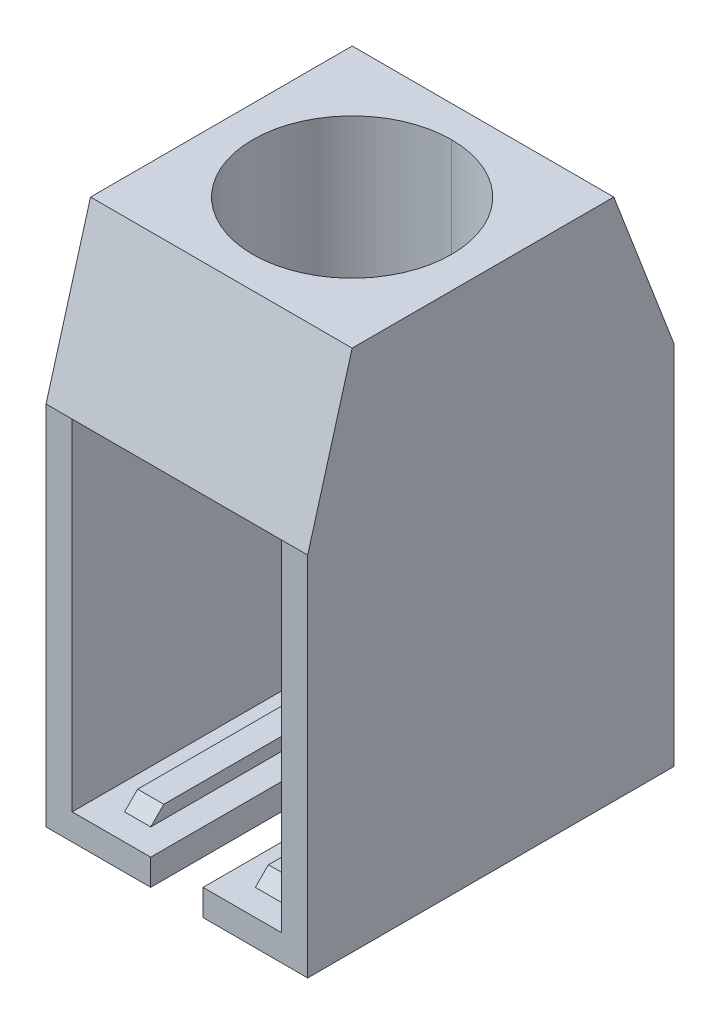
ISO-10303-21;
HEADER;
FILE_DESCRIPTION(('STEP AP214'),'2;1');
FILE_NAME('part.step','',(''),(''),'','','');
FILE_SCHEMA(('AUTOMOTIVE_DESIGN { 1 0 10303 214 1 1 1 1 }'));
ENDSEC;
DATA;
#1=APPLICATION_CONTEXT('core data for automotive mechanical design processes');
#2=APPLICATION_PROTOCOL_DEFINITION('international standard','automotive_design',2000,#1);
#3=PRODUCT_CONTEXT('',#1,'mechanical');
#4=PRODUCT('Part','Part','',(#3));
#5=PRODUCT_RELATED_PRODUCT_CATEGORY('part','',(#4));
#6=PRODUCT_DEFINITION_FORMATION('','',#4);
#7=PRODUCT_DEFINITION_CONTEXT('part definition',#1,'design');
#8=PRODUCT_DEFINITION('design','',#6,#7);
#9=PRODUCT_DEFINITION_SHAPE('','',#8);
#10=(LENGTH_UNIT() NAMED_UNIT(*) SI_UNIT(.MILLI.,.METRE.));
#11=(NAMED_UNIT(*) PLANE_ANGLE_UNIT() SI_UNIT($,.RADIAN.));
#12=(NAMED_UNIT(*) SI_UNIT($,.STERADIAN.) SOLID_ANGLE_UNIT());
#13=UNCERTAINTY_MEASURE_WITH_UNIT(LENGTH_MEASURE(1.E-05),#10,'distance_accuracy_value','');
#14=(GEOMETRIC_REPRESENTATION_CONTEXT(3) GLOBAL_UNCERTAINTY_ASSIGNED_CONTEXT((#13)) GLOBAL_UNIT_ASSIGNED_CONTEXT((#10,
#11,#12)) REPRESENTATION_CONTEXT('',''));
#15=CARTESIAN_POINT('',(0.,0.,0.));
#16=DIRECTION('',(0.,0.,1.));
#17=DIRECTION('',(1.,0.,0.));
#18=AXIS2_PLACEMENT_3D('',#15,#16,#17);
#19=CARTESIAN_POINT('',(-2.,6.5,3.));
#20=DIRECTION('',(0.,0.707106781186548,-0.707106781186547));
#21=DIRECTION('',(-1.,0.,0.));
#22=AXIS2_PLACEMENT_3D('',#19,#20,#21);
#23=PLANE('',#22);
#24=DIRECTION('',(0.,-0.707106781186547,-0.707106781186548));
#25=VECTOR('',#24,1.);
#26=CARTESIAN_POINT('',(2.,-0.355551275463989,-3.85555127546401));
#27=LINE('',#26,#25);
#28=CARTESIAN_POINT('',(2.,7.,3.5));
#29=VERTEX_POINT('',#28);
#30=CARTESIAN_POINT('',(2.,6.5,3.));
#31=VERTEX_POINT('',#30);
#32=EDGE_CURVE('E277',#29,#31,#27,.T.);
#33=ORIENTED_EDGE('',*,*,#32,.F.);
#34=DIRECTION('',(1.,0.,0.));
#35=VECTOR('',#34,1.);
#36=CARTESIAN_POINT('',(-2.5,7.,3.5));
#37=LINE('',#36,#35);
#38=CARTESIAN_POINT('',(-2.,7.,3.5));
#39=VERTEX_POINT('',#38);
#40=EDGE_CURVE('E261',#39,#29,#37,.T.);
#41=ORIENTED_EDGE('',*,*,#40,.F.);
#42=DIRECTION('',(0.,0.707106781186547,0.707106781186548));
#43=VECTOR('',#42,1.);
#44=CARTESIAN_POINT('',(-2.,-0.355551275463989,-3.85555127546401));
#45=LINE('',#44,#43);
#46=CARTESIAN_POINT('',(-2.,6.5,3.));
#47=VERTEX_POINT('',#46);
#48=EDGE_CURVE('E257',#47,#39,#45,.T.);
#49=ORIENTED_EDGE('',*,*,#48,.F.);
#50=DIRECTION('',(-1.,0.,0.));
#51=VECTOR('',#50,1.);
#52=CARTESIAN_POINT('',(-2.,6.5,3.));
#53=LINE('',#52,#51);
#54=EDGE_CURVE('E242',#31,#47,#53,.T.);
#55=ORIENTED_EDGE('',*,*,#54,.F.);
#56=EDGE_LOOP('',(#33,#41,#49,#55));
#57=FACE_BOUND('',#56,.T.);
#58=ADVANCED_FACE('F17',(#57),#23,.F.);
#59=CARTESIAN_POINT('',(0.,0.75,2.75));
#60=DIRECTION('',(0.,0.707106781186545,0.70710678118655));
#61=DIRECTION('',(1.,0.,0.));
#62=AXIS2_PLACEMENT_3D('',#59,#60,#61);
#63=PLANE('',#62);
#64=DIRECTION('',(0.,0.70710678118655,-0.707106781186545));
#65=VECTOR('',#64,1.);
#66=CARTESIAN_POINT('',(-1.5,0.749999999999976,2.75));
#67=LINE('',#66,#65);
#68=CARTESIAN_POINT('',(-1.5,0.5,3.));
#69=VERTEX_POINT('',#68);
#70=CARTESIAN_POINT('',(-1.5,0.75,2.75));
#71=VERTEX_POINT('',#70);
#72=EDGE_CURVE('E291',#69,#71,#67,.T.);
#73=ORIENTED_EDGE('',*,*,#72,.F.);
#74=DIRECTION('',(1.,0.,0.));
#75=VECTOR('',#74,1.);
#76=CARTESIAN_POINT('',(0.,0.5,3.));
#77=LINE('',#76,#75);
#78=CARTESIAN_POINT('',(-1.,0.5,3.));
#79=VERTEX_POINT('',#78);
#80=EDGE_CURVE('E377',#69,#79,#77,.T.);
#81=ORIENTED_EDGE('',*,*,#80,.T.);
#82=DIRECTION('',(0.,-0.70710678118655,0.707106781186545));
#83=VECTOR('',#82,1.);
#84=CARTESIAN_POINT('',(-1.,2.125,1.375));
#85=LINE('',#84,#83);
#86=CARTESIAN_POINT('',(-1.,0.75,2.75));
#87=VERTEX_POINT('',#86);
#88=EDGE_CURVE('E285',#87,#79,#85,.T.);
#89=ORIENTED_EDGE('',*,*,#88,.F.);
#90=DIRECTION('',(1.,0.,0.));
#91=VECTOR('',#90,1.);
#92=CARTESIAN_POINT('',(-1.,0.75,2.75));
#93=LINE('',#92,#91);
#94=EDGE_CURVE('E288',#71,#87,#93,.T.);
#95=ORIENTED_EDGE('',*,*,#94,.F.);
#96=EDGE_LOOP('',(#73,#81,#89,#95));
#97=FACE_BOUND('',#96,.T.);
#98=ADVANCED_FACE('F630',(#97),#63,.T.);
#99=CARTESIAN_POINT('',(0.,0.75,2.75));
#100=DIRECTION('',(0.,0.707106781186545,0.70710678118655));
#101=DIRECTION('',(1.,0.,0.));
#102=AXIS2_PLACEMENT_3D('',#99,#100,#101);
#103=PLANE('',#102);
#104=DIRECTION('',(0.,0.70710678118655,-0.707106781186545));
#105=VECTOR('',#104,1.);
#106=CARTESIAN_POINT('',(1.,0.75,2.75));
#107=LINE('',#106,#105);
#108=CARTESIAN_POINT('',(1.,0.5,3.));
#109=VERTEX_POINT('',#108);
#110=CARTESIAN_POINT('',(1.,0.75,2.75));
#111=VERTEX_POINT('',#110);
#112=EDGE_CURVE('E308',#109,#111,#107,.T.);
#113=ORIENTED_EDGE('',*,*,#112,.F.);
#114=DIRECTION('',(1.,0.,0.));
#115=VECTOR('',#114,1.);
#116=CARTESIAN_POINT('',(0.,0.5,3.));
#117=LINE('',#116,#115);
#118=CARTESIAN_POINT('',(1.5,0.5,3.));
#119=VERTEX_POINT('',#118);
#120=EDGE_CURVE('E352',#109,#119,#117,.T.);
#121=ORIENTED_EDGE('',*,*,#120,.T.);
#122=DIRECTION('',(0.,-0.70710678118655,0.707106781186545));
#123=VECTOR('',#122,1.);
#124=CARTESIAN_POINT('',(1.5,2.125,1.375));
#125=LINE('',#124,#123);
#126=CARTESIAN_POINT('',(1.5,0.75,2.75));
#127=VERTEX_POINT('',#126);
#128=EDGE_CURVE('E304',#127,#119,#125,.T.);
#129=ORIENTED_EDGE('',*,*,#128,.F.);
#130=DIRECTION('',(1.,0.,0.));
#131=VECTOR('',#130,1.);
#132=CARTESIAN_POINT('',(1.5,0.75,2.75));
#133=LINE('',#132,#131);
#134=EDGE_CURVE('E11',#111,#127,#133,.T.);
#135=ORIENTED_EDGE('',*,*,#134,.F.);
#136=EDGE_LOOP('',(#113,#121,#129,#135));
#137=FACE_BOUND('',#136,.T.);
#138=ADVANCED_FACE('F634',(#137),#103,.T.);
#139=CARTESIAN_POINT('',(0.,0.75,0.));
#140=DIRECTION('',(0.,1.,0.));
#141=DIRECTION('',(1.,0.,0.));
#142=AXIS2_PLACEMENT_3D('',#139,#140,#141);
#143=PLANE('',#142);
#144=DIRECTION('',(0.,0.,1.));
#145=VECTOR('',#144,1.);
#146=CARTESIAN_POINT('',(1.,0.75,0.));
#147=LINE('',#146,#145);
#148=CARTESIAN_POINT('',(1.,0.75,-3.));
#149=VERTEX_POINT('',#148);
#150=EDGE_CURVE('E20',#149,#111,#147,.T.);
#151=ORIENTED_EDGE('',*,*,#150,.T.);
#152=ORIENTED_EDGE('',*,*,#134,.T.);
#153=DIRECTION('',(0.,0.,1.));
#154=VECTOR('',#153,1.);
#155=CARTESIAN_POINT('',(1.5,0.75,0.));
#156=LINE('',#155,#154);
#157=CARTESIAN_POINT('',(1.5,0.75,-3.));
#158=VERTEX_POINT('',#157);
#159=EDGE_CURVE('E300',#158,#127,#156,.T.);
#160=ORIENTED_EDGE('',*,*,#159,.F.);
#161=DIRECTION('',(-1.,0.,0.));
#162=VECTOR('',#161,1.);
#163=CARTESIAN_POINT('',(0.,0.75,-3.));
#164=LINE('',#163,#162);
#165=EDGE_CURVE('E359',#158,#149,#164,.T.);
#166=ORIENTED_EDGE('',*,*,#165,.T.);
#167=EDGE_LOOP('',(#151,#152,#160,#166));
#168=FACE_BOUND('',#167,.T.);
#169=ADVANCED_FACE('F639',(#168),#143,.T.);
#170=CARTESIAN_POINT('',(1.,0.75,0.));
#171=DIRECTION('',(1.,0.,0.));
#172=DIRECTION('',(0.,0.,-1.));
#173=AXIS2_PLACEMENT_3D('',#170,#171,#172);
#174=PLANE('',#173);
#175=DIRECTION('',(0.,0.,1.));
#176=VECTOR('',#175,1.);
#177=CARTESIAN_POINT('',(1.,0.5,0.));
#178=LINE('',#177,#176);
#179=CARTESIAN_POINT('',(1.,0.5,-3.));
#180=VERTEX_POINT('',#179);
#181=EDGE_CURVE('E355',#180,#109,#178,.T.);
#182=ORIENTED_EDGE('',*,*,#181,.T.);
#183=ORIENTED_EDGE('',*,*,#112,.T.);
#184=ORIENTED_EDGE('',*,*,#150,.F.);
#185=DIRECTION('',(0.,-1.,0.));
#186=VECTOR('',#185,1.);
#187=CARTESIAN_POINT('',(1.,0.75,-3.));
#188=LINE('',#187,#186);
#189=EDGE_CURVE('E364',#149,#180,#188,.T.);
#190=ORIENTED_EDGE('',*,*,#189,.T.);
#191=EDGE_LOOP('',(#182,#183,#184,#190));
#192=FACE_BOUND('',#191,.T.);
#193=ADVANCED_FACE('F644',(#192),#174,.F.);
#194=CARTESIAN_POINT('',(1.5,0.75,0.));
#195=DIRECTION('',(1.,0.,0.));
#196=DIRECTION('',(0.,0.,-1.));
#197=AXIS2_PLACEMENT_3D('',#194,#195,#196);
#198=PLANE('',#197);
#199=ORIENTED_EDGE('',*,*,#159,.T.);
#200=ORIENTED_EDGE('',*,*,#128,.T.);
#201=DIRECTION('',(0.,0.,1.));
#202=VECTOR('',#201,1.);
#203=CARTESIAN_POINT('',(1.5,0.5,0.));
#204=LINE('',#203,#202);
#205=CARTESIAN_POINT('',(1.5,0.5,-3.));
#206=VERTEX_POINT('',#205);
#207=EDGE_CURVE('E336',#206,#119,#204,.T.);
#208=ORIENTED_EDGE('',*,*,#207,.F.);
#209=DIRECTION('',(0.,-1.,0.));
#210=VECTOR('',#209,1.);
#211=CARTESIAN_POINT('',(1.5,0.75,-3.));
#212=LINE('',#211,#210);
#213=EDGE_CURVE('E330',#158,#206,#212,.T.);
#214=ORIENTED_EDGE('',*,*,#213,.F.);
#215=EDGE_LOOP('',(#199,#200,#208,#214));
#216=FACE_BOUND('',#215,.T.);
#217=ADVANCED_FACE('F648',(#216),#198,.T.);
#218=CARTESIAN_POINT('',(0.,0.75,0.));
#219=DIRECTION('',(0.,1.,0.));
#220=DIRECTION('',(1.,0.,0.));
#221=AXIS2_PLACEMENT_3D('',#218,#219,#220);
#222=PLANE('',#221);
#223=DIRECTION('',(0.,0.,1.));
#224=VECTOR('',#223,1.);
#225=CARTESIAN_POINT('',(-1.5,0.75,0.));
#226=LINE('',#225,#224);
#227=CARTESIAN_POINT('',(-1.5,0.75,-3.));
#228=VERTEX_POINT('',#227);
#229=EDGE_CURVE('E296',#228,#71,#226,.T.);
#230=ORIENTED_EDGE('',*,*,#229,.T.);
#231=ORIENTED_EDGE('',*,*,#94,.T.);
#232=DIRECTION('',(0.,0.,1.));
#233=VECTOR('',#232,1.);
#234=CARTESIAN_POINT('',(-1.,0.75,0.));
#235=LINE('',#234,#233);
#236=CARTESIAN_POINT('',(-1.,0.75,-3.));
#237=VERTEX_POINT('',#236);
#238=EDGE_CURVE('E289',#237,#87,#235,.T.);
#239=ORIENTED_EDGE('',*,*,#238,.F.);
#240=DIRECTION('',(-1.,0.,0.));
#241=VECTOR('',#240,1.);
#242=CARTESIAN_POINT('',(0.,0.75,-3.));
#243=LINE('',#242,#241);
#244=EDGE_CURVE('E346',#237,#228,#243,.T.);
#245=ORIENTED_EDGE('',*,*,#244,.T.);
#246=EDGE_LOOP('',(#230,#231,#239,#245));
#247=FACE_BOUND('',#246,.T.);
#248=ADVANCED_FACE('F651',(#247),#222,.T.);
#249=CARTESIAN_POINT('',(-1.,0.75,0.));
#250=DIRECTION('',(1.,0.,0.));
#251=DIRECTION('',(0.,0.,1.));
#252=AXIS2_PLACEMENT_3D('',#249,#250,#251);
#253=PLANE('',#252);
#254=ORIENTED_EDGE('',*,*,#238,.T.);
#255=ORIENTED_EDGE('',*,*,#88,.T.);
#256=DIRECTION('',(0.,0.,1.));
#257=VECTOR('',#256,1.);
#258=CARTESIAN_POINT('',(-1.,0.5,0.));
#259=LINE('',#258,#257);
#260=CARTESIAN_POINT('',(-1.,0.5,-3.));
#261=VERTEX_POINT('',#260);
#262=EDGE_CURVE('E368',#261,#79,#259,.T.);
#263=ORIENTED_EDGE('',*,*,#262,.F.);
#264=DIRECTION('',(0.,-1.,0.));
#265=VECTOR('',#264,1.);
#266=CARTESIAN_POINT('',(-1.,0.75,-3.));
#267=LINE('',#266,#265);
#268=EDGE_CURVE('E350',#237,#261,#267,.T.);
#269=ORIENTED_EDGE('',*,*,#268,.F.);
#270=EDGE_LOOP('',(#254,#255,#263,#269));
#271=FACE_BOUND('',#270,.T.);
#272=ADVANCED_FACE('F654',(#271),#253,.T.);
#273=CARTESIAN_POINT('',(-1.5,0.75,0.));
#274=DIRECTION('',(1.,0.,0.));
#275=DIRECTION('',(0.,0.,-1.));
#276=AXIS2_PLACEMENT_3D('',#273,#274,#275);
#277=PLANE('',#276);
#278=DIRECTION('',(0.,0.,1.));
#279=VECTOR('',#278,1.);
#280=CARTESIAN_POINT('',(-1.5,0.5,0.));
#281=LINE('',#280,#279);
#282=CARTESIAN_POINT('',(-1.5,0.5,-3.));
#283=VERTEX_POINT('',#282);
#284=EDGE_CURVE('E381',#283,#69,#281,.T.);
#285=ORIENTED_EDGE('',*,*,#284,.T.);
#286=ORIENTED_EDGE('',*,*,#72,.T.);
#287=ORIENTED_EDGE('',*,*,#229,.F.);
#288=DIRECTION('',(0.,-1.,0.));
#289=VECTOR('',#288,1.);
#290=CARTESIAN_POINT('',(-1.5,0.75,-3.));
#291=LINE('',#290,#289);
#292=EDGE_CURVE('E351',#228,#283,#291,.T.);
#293=ORIENTED_EDGE('',*,*,#292,.T.);
#294=EDGE_LOOP('',(#285,#286,#287,#293));
#295=FACE_BOUND('',#294,.T.);
#296=ADVANCED_FACE('F658',(#295),#277,.F.);
#297=CARTESIAN_POINT('',(-0.5,10.001,3.5));
#298=DIRECTION('',(-1.,0.,0.));
#299=DIRECTION('',(0.,0.,1.));
#300=AXIS2_PLACEMENT_3D('',#297,#298,#299);
#301=PLANE('',#300);
#302=DIRECTION('',(0.,0.,1.));
#303=VECTOR('',#302,1.);
#304=CARTESIAN_POINT('',(-0.5,0.5,3.5));
#305=LINE('',#304,#303);
#306=CARTESIAN_POINT('',(-0.5,0.5,0.15));
#307=VERTEX_POINT('',#306);
#308=CARTESIAN_POINT('',(-0.5,0.5,3.5));
#309=VERTEX_POINT('',#308);
#310=EDGE_CURVE('E387',#307,#309,#305,.T.);
#311=ORIENTED_EDGE('',*,*,#310,.T.);
#312=DIRECTION('',(0.,-1.,0.));
#313=VECTOR('',#312,1.);
#314=CARTESIAN_POINT('',(-0.5,10.001,3.5));
#315=LINE('',#314,#313);
#316=CARTESIAN_POINT('',(-0.5,0.,3.5));
#317=VERTEX_POINT('',#316);
#318=EDGE_CURVE('E345',#309,#317,#315,.T.);
#319=ORIENTED_EDGE('',*,*,#318,.T.);
#320=DIRECTION('',(0.,0.,-1.));
#321=VECTOR('',#320,1.);
#322=CARTESIAN_POINT('',(-0.5,0.,3.5));
#323=LINE('',#322,#321);
#324=CARTESIAN_POINT('',(-0.5,0.,0.15));
#325=VERTEX_POINT('',#324);
#326=EDGE_CURVE('E372',#317,#325,#323,.T.);
#327=ORIENTED_EDGE('',*,*,#326,.T.);
#328=DIRECTION('',(0.,-1.,0.));
#329=VECTOR('',#328,1.);
#330=CARTESIAN_POINT('',(-0.5,10.001,0.15));
#331=LINE('',#330,#329);
#332=EDGE_CURVE('E284',#307,#325,#331,.T.);
#333=ORIENTED_EDGE('',*,*,#332,.F.);
#334=EDGE_LOOP('',(#311,#319,#327,#333));
#335=FACE_BOUND('',#334,.T.);
#336=ADVANCED_FACE('F594',(#335),#301,.F.);
#337=CARTESIAN_POINT('',(0.,10.001,0.15));
#338=DIRECTION('',(0.,-1.,0.));
#339=DIRECTION('',(0.,0.,-1.));
#340=AXIS2_PLACEMENT_3D('',#337,#338,#339);
#341=CYLINDRICAL_SURFACE('',#340,0.5);
#342=DIRECTION('',(0.,-1.,0.));
#343=VECTOR('',#342,1.);
#344=CARTESIAN_POINT('',(0.,10.001,-0.35));
#345=LINE('',#344,#343);
#346=CARTESIAN_POINT('',(0.,0.5,-0.35));
#347=VERTEX_POINT('',#346);
#348=CARTESIAN_POINT('',(0.,0.,-0.35));
#349=VERTEX_POINT('',#348);
#350=EDGE_CURVE('E569',#347,#349,#345,.T.);
#351=ORIENTED_EDGE('',*,*,#350,.F.);
#352=CARTESIAN_POINT('',(0.,0.5,0.15));
#353=DIRECTION('',(0.,1.,0.));
#354=DIRECTION('',(0.,0.,-1.));
#355=AXIS2_PLACEMENT_3D('',#352,#353,#354);
#356=CIRCLE('',#355,0.5);
#357=EDGE_CURVE('E382',#347,#307,#356,.T.);
#358=ORIENTED_EDGE('',*,*,#357,.T.);
#359=ORIENTED_EDGE('',*,*,#332,.T.);
#360=CARTESIAN_POINT('',(0.,0.,0.15));
#361=DIRECTION('',(0.,-1.,0.));
#362=DIRECTION('',(0.,0.,-1.));
#363=AXIS2_PLACEMENT_3D('',#360,#361,#362);
#364=CIRCLE('',#363,0.5);
#365=EDGE_CURVE('E369',#325,#349,#364,.T.);
#366=ORIENTED_EDGE('',*,*,#365,.T.);
#367=EDGE_LOOP('',(#351,#358,#359,#366));
#368=FACE_BOUND('',#367,.T.);
#369=ADVANCED_FACE('F663',(#368),#341,.F.);
#370=CARTESIAN_POINT('',(0.5,10.001,0.15));
#371=DIRECTION('',(1.,0.,0.));
#372=DIRECTION('',(0.,0.,1.));
#373=AXIS2_PLACEMENT_3D('',#370,#371,#372);
#374=PLANE('',#373);
#375=DIRECTION('',(0.,0.,-1.));
#376=VECTOR('',#375,1.);
#377=CARTESIAN_POINT('',(0.5,0.5,0.15));
#378=LINE('',#377,#376);
#379=CARTESIAN_POINT('',(0.5,0.5,3.5));
#380=VERTEX_POINT('',#379);
#381=CARTESIAN_POINT('',(0.5,0.5,0.15));
#382=VERTEX_POINT('',#381);
#383=EDGE_CURVE('E386',#380,#382,#378,.T.);
#384=ORIENTED_EDGE('',*,*,#383,.T.);
#385=DIRECTION('',(0.,-1.,0.));
#386=VECTOR('',#385,1.);
#387=CARTESIAN_POINT('',(0.5,10.001,0.15));
#388=LINE('',#387,#386);
#389=CARTESIAN_POINT('',(0.5,0.,0.15));
#390=VERTEX_POINT('',#389);
#391=EDGE_CURVE('E559',#382,#390,#388,.T.);
#392=ORIENTED_EDGE('',*,*,#391,.T.);
#393=DIRECTION('',(0.,0.,1.));
#394=VECTOR('',#393,1.);
#395=CARTESIAN_POINT('',(0.5,0.,0.15));
#396=LINE('',#395,#394);
#397=CARTESIAN_POINT('',(0.5,0.,3.5));
#398=VERTEX_POINT('',#397);
#399=EDGE_CURVE('E373',#390,#398,#396,.T.);
#400=ORIENTED_EDGE('',*,*,#399,.T.);
#401=DIRECTION('',(0.,-1.,0.));
#402=VECTOR('',#401,1.);
#403=CARTESIAN_POINT('',(0.5,10.001,3.5));
#404=LINE('',#403,#402);
#405=EDGE_CURVE('E446',#380,#398,#404,.T.);
#406=ORIENTED_EDGE('',*,*,#405,.F.);
#407=EDGE_LOOP('',(#384,#392,#400,#406));
#408=FACE_BOUND('',#407,.T.);
#409=ADVANCED_FACE('F611',(#408),#374,.F.);
#410=CARTESIAN_POINT('',(0.,-0.000999999999999265,0.15));
#411=DIRECTION('',(0.,1.,0.));
#412=DIRECTION('',(0.,0.,1.));
#413=AXIS2_PLACEMENT_3D('',#410,#411,#412);
#414=CYLINDRICAL_SURFACE('',#413,1.9);
#415=DIRECTION('',(0.,1.,0.));
#416=VECTOR('',#415,1.);
#417=CARTESIAN_POINT('',(0.,-0.000999999999999265,-1.75));
#418=LINE('',#417,#416);
#419=CARTESIAN_POINT('',(0.,6.5,-1.75));
#420=VERTEX_POINT('',#419);
#421=CARTESIAN_POINT('',(0.,10.,-1.75));
#422=VERTEX_POINT('',#421);
#423=EDGE_CURVE('E544',#420,#422,#418,.T.);
#424=ORIENTED_EDGE('',*,*,#423,.F.);
#425=CARTESIAN_POINT('',(0.,6.5,0.15));
#426=DIRECTION('',(0.,-1.,0.));
#427=DIRECTION('',(0.,0.,1.));
#428=AXIS2_PLACEMENT_3D('',#425,#426,#427);
#429=CIRCLE('',#428,1.9);
#430=CARTESIAN_POINT('',(0.,6.5,2.05));
#431=VERTEX_POINT('',#430);
#432=EDGE_CURVE('E256',#420,#431,#429,.T.);
#433=ORIENTED_EDGE('',*,*,#432,.T.);
#434=DIRECTION('',(0.,1.,0.));
#435=VECTOR('',#434,1.);
#436=CARTESIAN_POINT('',(0.,-0.000999999999999265,2.05));
#437=LINE('',#436,#435);
#438=CARTESIAN_POINT('',(0.,10.,2.05));
#439=VERTEX_POINT('',#438);
#440=EDGE_CURVE('E532',#431,#439,#437,.T.);
#441=ORIENTED_EDGE('',*,*,#440,.T.);
#442=CARTESIAN_POINT('',(0.,10.,0.15));
#443=DIRECTION('',(0.,1.,0.));
#444=DIRECTION('',(0.,0.,1.));
#445=AXIS2_PLACEMENT_3D('',#442,#443,#444);
#446=CIRCLE('',#445,1.9);
#447=EDGE_CURVE('E490',#439,#422,#446,.T.);
#448=ORIENTED_EDGE('',*,*,#447,.T.);
#449=EDGE_LOOP('',(#424,#433,#441,#448));
#450=FACE_BOUND('',#449,.T.);
#451=ADVANCED_FACE('F669',(#450),#414,.F.);
#452=CARTESIAN_POINT('',(-2.,6.5,-10.711102550928));
#453=DIRECTION('',(0.,1.,0.));
#454=DIRECTION('',(1.,0.,0.));
#455=AXIS2_PLACEMENT_3D('',#452,#453,#454);
#456=PLANE('',#455);
#457=CARTESIAN_POINT('',(0.,6.5,0.15));
#458=DIRECTION('',(0.,-1.,0.));
#459=DIRECTION('',(0.,0.,1.));
#460=AXIS2_PLACEMENT_3D('',#457,#458,#459);
#461=CIRCLE('',#460,1.9);
#462=EDGE_CURVE('E553',#431,#420,#461,.T.);
#463=ORIENTED_EDGE('',*,*,#462,.F.);
#464=ORIENTED_EDGE('',*,*,#432,.F.);
#465=EDGE_LOOP('',(#463,#464));
#466=FACE_BOUND('',#465,.T.);
#467=DIRECTION('',(0.,0.,1.));
#468=VECTOR('',#467,1.);
#469=CARTESIAN_POINT('',(2.,6.5,-10.711102550928));
#470=LINE('',#469,#468);
#471=CARTESIAN_POINT('',(2.,6.5,-3.));
#472=VERTEX_POINT('',#471);
#473=EDGE_CURVE('E253',#472,#31,#470,.T.);
#474=ORIENTED_EDGE('',*,*,#473,.T.);
#475=ORIENTED_EDGE('',*,*,#54,.T.);
#476=DIRECTION('',(0.,0.,1.));
#477=VECTOR('',#476,1.);
#478=CARTESIAN_POINT('',(-2.,6.5,-10.711102550928));
#479=LINE('',#478,#477);
#480=CARTESIAN_POINT('',(-2.,6.5,-3.));
#481=VERTEX_POINT('',#480);
#482=EDGE_CURVE('E251',#481,#47,#479,.T.);
#483=ORIENTED_EDGE('',*,*,#482,.F.);
#484=DIRECTION('',(1.,0.,0.));
#485=VECTOR('',#484,1.);
#486=CARTESIAN_POINT('',(-2.,6.5,-3.));
#487=LINE('',#486,#485);
#488=EDGE_CURVE('E415',#481,#472,#487,.T.);
#489=ORIENTED_EDGE('',*,*,#488,.T.);
#490=EDGE_LOOP('',(#474,#475,#483,#489));
#491=FACE_BOUND('',#490,.T.);
#492=ADVANCED_FACE('F248',(#466,#491),#456,.F.);
#493=CARTESIAN_POINT('',(-2.,6.5,-10.711102550928));
#494=DIRECTION('',(-1.,0.,0.));
#495=DIRECTION('',(0.,0.,1.));
#496=AXIS2_PLACEMENT_3D('',#493,#494,#495);
#497=PLANE('',#496);
#498=DIRECTION('',(0.,1.,0.));
#499=VECTOR('',#498,1.);
#500=CARTESIAN_POINT('',(-2.,6.5,-3.));
#501=LINE('',#500,#499);
#502=CARTESIAN_POINT('',(-2.,0.5,-3.));
#503=VERTEX_POINT('',#502);
#504=EDGE_CURVE('E269',#503,#481,#501,.T.);
#505=ORIENTED_EDGE('',*,*,#504,.T.);
#506=ORIENTED_EDGE('',*,*,#482,.T.);
#507=ORIENTED_EDGE('',*,*,#48,.T.);
#508=DIRECTION('',(0.,-1.,0.));
#509=VECTOR('',#508,1.);
#510=CARTESIAN_POINT('',(-2.,6.5,3.5));
#511=LINE('',#510,#509);
#512=CARTESIAN_POINT('',(-2.,0.5,3.5));
#513=VERTEX_POINT('',#512);
#514=EDGE_CURVE('E324',#39,#513,#511,.T.);
#515=ORIENTED_EDGE('',*,*,#514,.T.);
#516=DIRECTION('',(0.,0.,1.));
#517=VECTOR('',#516,1.);
#518=CARTESIAN_POINT('',(-2.,0.5,-10.711102550928));
#519=LINE('',#518,#517);
#520=EDGE_CURVE('E401',#503,#513,#519,.T.);
#521=ORIENTED_EDGE('',*,*,#520,.F.);
#522=EDGE_LOOP('',(#505,#506,#507,#515,#521));
#523=FACE_BOUND('',#522,.T.);
#524=ADVANCED_FACE('F267',(#523),#497,.F.);
#525=CARTESIAN_POINT('',(2.,6.5,-10.711102550928));
#526=DIRECTION('',(1.,0.,0.));
#527=DIRECTION('',(0.,1.,0.));
#528=AXIS2_PLACEMENT_3D('',#525,#526,#527);
#529=PLANE('',#528);
#530=DIRECTION('',(0.,-1.,0.));
#531=VECTOR('',#530,1.);
#532=CARTESIAN_POINT('',(2.,6.5,-3.));
#533=LINE('',#532,#531);
#534=CARTESIAN_POINT('',(2.,0.5,-3.));
#535=VERTEX_POINT('',#534);
#536=EDGE_CURVE('E414',#472,#535,#533,.T.);
#537=ORIENTED_EDGE('',*,*,#536,.T.);
#538=DIRECTION('',(0.,0.,1.));
#539=VECTOR('',#538,1.);
#540=CARTESIAN_POINT('',(2.,0.5,-10.711102550928));
#541=LINE('',#540,#539);
#542=CARTESIAN_POINT('',(2.,0.5,3.5));
#543=VERTEX_POINT('',#542);
#544=EDGE_CURVE('E326',#535,#543,#541,.T.);
#545=ORIENTED_EDGE('',*,*,#544,.T.);
#546=DIRECTION('',(0.,1.,0.));
#547=VECTOR('',#546,1.);
#548=CARTESIAN_POINT('',(2.,6.5,3.5));
#549=LINE('',#548,#547);
#550=EDGE_CURVE('E440',#543,#29,#549,.T.);
#551=ORIENTED_EDGE('',*,*,#550,.T.);
#552=ORIENTED_EDGE('',*,*,#32,.T.);
#553=ORIENTED_EDGE('',*,*,#473,.F.);
#554=EDGE_LOOP('',(#537,#545,#551,#552,#553));
#555=FACE_BOUND('',#554,.T.);
#556=ADVANCED_FACE('F504',(#555),#529,.F.);
#557=CARTESIAN_POINT('',(-2.5,7.,3.5));
#558=DIRECTION('',(0.,-0.272602572456025,-0.962126726315384));
#559=DIRECTION('',(0.,-0.962126726315384,0.272602572456025));
#560=AXIS2_PLACEMENT_3D('',#557,#558,#559);
#561=PLANE('',#560);
#562=DIRECTION('',(0.,0.962126726315384,-0.272602572456025));
#563=VECTOR('',#562,1.);
#564=CARTESIAN_POINT('',(2.5,7.,3.5));
#565=LINE('',#564,#563);
#566=CARTESIAN_POINT('',(2.5,7.,3.5));
#567=VERTEX_POINT('',#566);
#568=CARTESIAN_POINT('',(2.5,10.,2.65));
#569=VERTEX_POINT('',#568);
#570=EDGE_CURVE('E468',#567,#569,#565,.T.);
#571=ORIENTED_EDGE('',*,*,#570,.T.);
#572=DIRECTION('',(1.,0.,0.));
#573=VECTOR('',#572,1.);
#574=CARTESIAN_POINT('',(-2.5,10.,2.65));
#575=LINE('',#574,#573);
#576=CARTESIAN_POINT('',(-2.5,10.,2.65));
#577=VERTEX_POINT('',#576);
#578=EDGE_CURVE('E484',#577,#569,#575,.T.);
#579=ORIENTED_EDGE('',*,*,#578,.F.);
#580=DIRECTION('',(0.,0.962126726315384,-0.272602572456025));
#581=VECTOR('',#580,1.);
#582=CARTESIAN_POINT('',(-2.5,7.,3.5));
#583=LINE('',#582,#581);
#584=CARTESIAN_POINT('',(-2.5,7.,3.5));
#585=VERTEX_POINT('',#584);
#586=EDGE_CURVE('E363',#585,#577,#583,.T.);
#587=ORIENTED_EDGE('',*,*,#586,.F.);
#588=DIRECTION('',(1.,0.,0.));
#589=VECTOR('',#588,1.);
#590=CARTESIAN_POINT('',(-2.5,7.,3.5));
#591=LINE('',#590,#589);
#592=EDGE_CURVE('E338',#585,#39,#591,.T.);
#593=ORIENTED_EDGE('',*,*,#592,.T.);
#594=ORIENTED_EDGE('',*,*,#40,.T.);
#595=DIRECTION('',(1.,0.,0.));
#596=VECTOR('',#595,1.);
#597=CARTESIAN_POINT('',(-2.5,7.,3.5));
#598=LINE('',#597,#596);
#599=EDGE_CURVE('E436',#29,#567,#598,.T.);
#600=ORIENTED_EDGE('',*,*,#599,.T.);
#601=EDGE_LOOP('',(#571,#579,#587,#593,#594,#600));
#602=FACE_BOUND('',#601,.T.);
#603=ADVANCED_FACE('F511',(#602),#561,.F.);
#604=CARTESIAN_POINT('',(-2.5,7.,-3.5));
#605=DIRECTION('',(0.,-0.357936011632452,0.93374611730205));
#606=DIRECTION('',(-1.,0.,0.));
#607=AXIS2_PLACEMENT_3D('',#604,#605,#606);
#608=PLANE('',#607);
#609=DIRECTION('',(0.,-0.93374611730205,-0.357936011632452));
#610=VECTOR('',#609,1.);
#611=CARTESIAN_POINT('',(2.5,7.,-3.5));
#612=LINE('',#611,#610);
#613=CARTESIAN_POINT('',(2.5,10.,-2.35));
#614=VERTEX_POINT('',#613);
#615=CARTESIAN_POINT('',(2.5,7.,-3.5));
#616=VERTEX_POINT('',#615);
#617=EDGE_CURVE('E459',#614,#616,#612,.T.);
#618=ORIENTED_EDGE('',*,*,#617,.T.);
#619=DIRECTION('',(1.,0.,0.));
#620=VECTOR('',#619,1.);
#621=CARTESIAN_POINT('',(-2.5,7.,-3.5));
#622=LINE('',#621,#620);
#623=CARTESIAN_POINT('',(-2.5,7.,-3.5));
#624=VERTEX_POINT('',#623);
#625=EDGE_CURVE('E478',#624,#616,#622,.T.);
#626=ORIENTED_EDGE('',*,*,#625,.F.);
#627=DIRECTION('',(0.,-0.93374611730205,-0.357936011632452));
#628=VECTOR('',#627,1.);
#629=CARTESIAN_POINT('',(-2.5,7.,-3.5));
#630=LINE('',#629,#628);
#631=CARTESIAN_POINT('',(-2.5,10.,-2.35));
#632=VERTEX_POINT('',#631);
#633=EDGE_CURVE('E392',#632,#624,#630,.T.);
#634=ORIENTED_EDGE('',*,*,#633,.F.);
#635=DIRECTION('',(1.,0.,0.));
#636=VECTOR('',#635,1.);
#637=CARTESIAN_POINT('',(-2.5,10.,-2.35));
#638=LINE('',#637,#636);
#639=EDGE_CURVE('E487',#632,#614,#638,.T.);
#640=ORIENTED_EDGE('',*,*,#639,.T.);
#641=EDGE_LOOP('',(#618,#626,#634,#640));
#642=FACE_BOUND('',#641,.T.);
#643=ADVANCED_FACE('F617',(#642),#608,.F.);
#644=CARTESIAN_POINT('',(0.,0.,0.));
#645=DIRECTION('',(0.,-1.,0.));
#646=DIRECTION('',(0.,0.,-1.));
#647=AXIS2_PLACEMENT_3D('',#644,#645,#646);
#648=PLANE('',#647);
#649=ORIENTED_EDGE('',*,*,#399,.F.);
#650=CARTESIAN_POINT('',(0.,0.,0.15));
#651=DIRECTION('',(0.,-1.,0.));
#652=DIRECTION('',(0.,0.,-1.));
#653=AXIS2_PLACEMENT_3D('',#650,#651,#652);
#654=CIRCLE('',#653,0.5);
#655=EDGE_CURVE('E563',#349,#390,#654,.T.);
#656=ORIENTED_EDGE('',*,*,#655,.F.);
#657=ORIENTED_EDGE('',*,*,#365,.F.);
#658=ORIENTED_EDGE('',*,*,#326,.F.);
#659=DIRECTION('',(1.,0.,0.));
#660=VECTOR('',#659,1.);
#661=CARTESIAN_POINT('',(2.5,0.,3.5));
#662=LINE('',#661,#660);
#663=CARTESIAN_POINT('',(-2.5,0.,3.5));
#664=VERTEX_POINT('',#663);
#665=EDGE_CURVE('E549',#664,#317,#662,.T.);
#666=ORIENTED_EDGE('',*,*,#665,.F.);
#667=DIRECTION('',(0.,0.,1.));
#668=VECTOR('',#667,1.);
#669=CARTESIAN_POINT('',(-2.5,0.,-3.5));
#670=LINE('',#669,#668);
#671=CARTESIAN_POINT('',(-2.5,0.,-3.5));
#672=VERTEX_POINT('',#671);
#673=EDGE_CURVE('E435',#672,#664,#670,.T.);
#674=ORIENTED_EDGE('',*,*,#673,.F.);
#675=DIRECTION('',(-1.,0.,0.));
#676=VECTOR('',#675,1.);
#677=CARTESIAN_POINT('',(2.5,0.,-3.5));
#678=LINE('',#677,#676);
#679=CARTESIAN_POINT('',(2.5,0.,-3.5));
#680=VERTEX_POINT('',#679);
#681=EDGE_CURVE('E481',#680,#672,#678,.T.);
#682=ORIENTED_EDGE('',*,*,#681,.F.);
#683=DIRECTION('',(0.,0.,-1.));
#684=VECTOR('',#683,1.);
#685=CARTESIAN_POINT('',(2.5,0.,-3.5));
#686=LINE('',#685,#684);
#687=CARTESIAN_POINT('',(2.5,0.,3.5));
#688=VERTEX_POINT('',#687);
#689=EDGE_CURVE('E460',#688,#680,#686,.T.);
#690=ORIENTED_EDGE('',*,*,#689,.F.);
#691=DIRECTION('',(1.,0.,0.));
#692=VECTOR('',#691,1.);
#693=CARTESIAN_POINT('',(2.5,0.,3.5));
#694=LINE('',#693,#692);
#695=EDGE_CURVE('E450',#398,#688,#694,.T.);
#696=ORIENTED_EDGE('',*,*,#695,.F.);
#697=EDGE_LOOP('',(#649,#656,#657,#658,#666,#674,#682,#690,#696));
#698=FACE_BOUND('',#697,.T.);
#699=ADVANCED_FACE('F590',(#698),#648,.T.);
#700=CARTESIAN_POINT('',(0.,10.,0.));
#701=DIRECTION('',(0.,-1.,0.));
#702=DIRECTION('',(0.,0.,-1.));
#703=AXIS2_PLACEMENT_3D('',#700,#701,#702);
#704=PLANE('',#703);
#705=ORIENTED_EDGE('',*,*,#447,.F.);
#706=CARTESIAN_POINT('',(0.,10.,0.15));
#707=DIRECTION('',(0.,1.,0.));
#708=DIRECTION('',(0.,0.,1.));
#709=AXIS2_PLACEMENT_3D('',#706,#707,#708);
#710=CIRCLE('',#709,1.9);
#711=EDGE_CURVE('E537',#422,#439,#710,.T.);
#712=ORIENTED_EDGE('',*,*,#711,.F.);
#713=EDGE_LOOP('',(#705,#712));
#714=FACE_BOUND('',#713,.T.);
#715=DIRECTION('',(0.,0.,1.));
#716=VECTOR('',#715,1.);
#717=CARTESIAN_POINT('',(-2.5,10.,-3.5));
#718=LINE('',#717,#716);
#719=EDGE_CURVE('E397',#632,#577,#718,.T.);
#720=ORIENTED_EDGE('',*,*,#719,.T.);
#721=ORIENTED_EDGE('',*,*,#578,.T.);
#722=DIRECTION('',(0.,0.,-1.));
#723=VECTOR('',#722,1.);
#724=CARTESIAN_POINT('',(2.5,10.,-3.5));
#725=LINE('',#724,#723);
#726=EDGE_CURVE('E464',#569,#614,#725,.T.);
#727=ORIENTED_EDGE('',*,*,#726,.T.);
#728=ORIENTED_EDGE('',*,*,#639,.F.);
#729=EDGE_LOOP('',(#720,#721,#727,#728));
#730=FACE_BOUND('',#729,.T.);
#731=ADVANCED_FACE('F518',(#714,#730),#704,.F.);
#732=CARTESIAN_POINT('',(2.5,10.,-3.5));
#733=DIRECTION('',(0.,0.,1.));
#734=DIRECTION('',(1.,0.,0.));
#735=AXIS2_PLACEMENT_3D('',#732,#733,#734);
#736=PLANE('',#735);
#737=DIRECTION('',(0.,-1.,0.));
#738=VECTOR('',#737,1.);
#739=CARTESIAN_POINT('',(-2.5,10.,-3.5));
#740=LINE('',#739,#738);
#741=EDGE_CURVE('E396',#624,#672,#740,.T.);
#742=ORIENTED_EDGE('',*,*,#741,.F.);
#743=ORIENTED_EDGE('',*,*,#625,.T.);
#744=DIRECTION('',(0.,-1.,0.));
#745=VECTOR('',#744,1.);
#746=CARTESIAN_POINT('',(2.5,10.,-3.5));
#747=LINE('',#746,#745);
#748=EDGE_CURVE('E455',#616,#680,#747,.T.);
#749=ORIENTED_EDGE('',*,*,#748,.T.);
#750=ORIENTED_EDGE('',*,*,#681,.T.);
#751=EDGE_LOOP('',(#742,#743,#749,#750));
#752=FACE_BOUND('',#751,.T.);
#753=ADVANCED_FACE('F615',(#752),#736,.F.);
#754=CARTESIAN_POINT('',(2.5,10.,-3.5));
#755=DIRECTION('',(-1.,0.,0.));
#756=DIRECTION('',(0.,1.,0.));
#757=AXIS2_PLACEMENT_3D('',#754,#755,#756);
#758=PLANE('',#757);
#759=ORIENTED_EDGE('',*,*,#726,.F.);
#760=ORIENTED_EDGE('',*,*,#570,.F.);
#761=DIRECTION('',(0.,-1.,0.));
#762=VECTOR('',#761,1.);
#763=CARTESIAN_POINT('',(2.5,10.,3.5));
#764=LINE('',#763,#762);
#765=EDGE_CURVE('E454',#567,#688,#764,.T.);
#766=ORIENTED_EDGE('',*,*,#765,.T.);
#767=ORIENTED_EDGE('',*,*,#689,.T.);
#768=ORIENTED_EDGE('',*,*,#748,.F.);
#769=ORIENTED_EDGE('',*,*,#617,.F.);
#770=EDGE_LOOP('',(#759,#760,#766,#767,#768,#769));
#771=FACE_BOUND('',#770,.T.);
#772=ADVANCED_FACE('F515',(#771),#758,.F.);
#773=CARTESIAN_POINT('',(2.5,10.,3.5));
#774=DIRECTION('',(0.,0.,-1.));
#775=DIRECTION('',(-1.,0.,0.));
#776=AXIS2_PLACEMENT_3D('',#773,#774,#775);
#777=PLANE('',#776);
#778=ORIENTED_EDGE('',*,*,#599,.F.);
#779=ORIENTED_EDGE('',*,*,#550,.F.);
#780=DIRECTION('',(1.,0.,0.));
#781=VECTOR('',#780,1.);
#782=CARTESIAN_POINT('',(-2.,0.5,3.5));
#783=LINE('',#782,#781);
#784=EDGE_CURVE('E331',#380,#543,#783,.T.);
#785=ORIENTED_EDGE('',*,*,#784,.F.);
#786=ORIENTED_EDGE('',*,*,#405,.T.);
#787=ORIENTED_EDGE('',*,*,#695,.T.);
#788=ORIENTED_EDGE('',*,*,#765,.F.);
#789=EDGE_LOOP('',(#778,#779,#785,#786,#787,#788));
#790=FACE_BOUND('',#789,.T.);
#791=ADVANCED_FACE('F510',(#790),#777,.F.);
#792=CARTESIAN_POINT('',(-2.5,10.,-3.5));
#793=DIRECTION('',(1.,0.,0.));
#794=DIRECTION('',(0.,0.,-1.));
#795=AXIS2_PLACEMENT_3D('',#792,#793,#794);
#796=PLANE('',#795);
#797=DIRECTION('',(0.,-1.,0.));
#798=VECTOR('',#797,1.);
#799=CARTESIAN_POINT('',(-2.5,10.,3.5));
#800=LINE('',#799,#798);
#801=EDGE_CURVE('E341',#585,#664,#800,.T.);
#802=ORIENTED_EDGE('',*,*,#801,.F.);
#803=ORIENTED_EDGE('',*,*,#586,.T.);
#804=ORIENTED_EDGE('',*,*,#719,.F.);
#805=ORIENTED_EDGE('',*,*,#633,.T.);
#806=ORIENTED_EDGE('',*,*,#741,.T.);
#807=ORIENTED_EDGE('',*,*,#673,.T.);
#808=EDGE_LOOP('',(#802,#803,#804,#805,#806,#807));
#809=FACE_BOUND('',#808,.T.);
#810=ADVANCED_FACE('F523',(#809),#796,.F.);
#811=CARTESIAN_POINT('',(2.5,10.,-3.));
#812=DIRECTION('',(0.,0.,1.));
#813=DIRECTION('',(1.,0.,0.));
#814=AXIS2_PLACEMENT_3D('',#811,#812,#813);
#815=PLANE('',#814);
#816=ORIENTED_EDGE('',*,*,#213,.T.);
#817=DIRECTION('',(-1.,0.,0.));
#818=VECTOR('',#817,1.);
#819=CARTESIAN_POINT('',(-2.,0.5,-3.));
#820=LINE('',#819,#818);
#821=EDGE_CURVE('E332',#535,#206,#820,.T.);
#822=ORIENTED_EDGE('',*,*,#821,.F.);
#823=ORIENTED_EDGE('',*,*,#536,.F.);
#824=ORIENTED_EDGE('',*,*,#488,.F.);
#825=ORIENTED_EDGE('',*,*,#504,.F.);
#826=DIRECTION('',(-1.,0.,0.));
#827=VECTOR('',#826,1.);
#828=CARTESIAN_POINT('',(-2.,0.5,-3.));
#829=LINE('',#828,#827);
#830=EDGE_CURVE('E391',#283,#503,#829,.T.);
#831=ORIENTED_EDGE('',*,*,#830,.F.);
#832=ORIENTED_EDGE('',*,*,#292,.F.);
#833=ORIENTED_EDGE('',*,*,#244,.F.);
#834=ORIENTED_EDGE('',*,*,#268,.T.);
#835=DIRECTION('',(-1.,0.,0.));
#836=VECTOR('',#835,1.);
#837=CARTESIAN_POINT('',(-2.,0.5,-3.));
#838=LINE('',#837,#836);
#839=EDGE_CURVE('E358',#180,#261,#838,.T.);
#840=ORIENTED_EDGE('',*,*,#839,.F.);
#841=ORIENTED_EDGE('',*,*,#189,.F.);
#842=ORIENTED_EDGE('',*,*,#165,.F.);
#843=EDGE_LOOP('',(#816,#822,#823,#824,#825,#831,#832,#833,#834,#840,#841,#842));
#844=FACE_BOUND('',#843,.T.);
#845=ADVANCED_FACE('F603',(#844),#815,.T.);
#846=CARTESIAN_POINT('',(-2.,0.5,-10.711102550928));
#847=DIRECTION('',(0.,-1.,0.));
#848=DIRECTION('',(0.,0.,-1.));
#849=AXIS2_PLACEMENT_3D('',#846,#847,#848);
#850=PLANE('',#849);
#851=ORIENTED_EDGE('',*,*,#821,.T.);
#852=ORIENTED_EDGE('',*,*,#207,.T.);
#853=ORIENTED_EDGE('',*,*,#120,.F.);
#854=ORIENTED_EDGE('',*,*,#181,.F.);
#855=ORIENTED_EDGE('',*,*,#839,.T.);
#856=ORIENTED_EDGE('',*,*,#262,.T.);
#857=ORIENTED_EDGE('',*,*,#80,.F.);
#858=ORIENTED_EDGE('',*,*,#284,.F.);
#859=ORIENTED_EDGE('',*,*,#830,.T.);
#860=ORIENTED_EDGE('',*,*,#520,.T.);
#861=DIRECTION('',(1.,0.,0.));
#862=VECTOR('',#861,1.);
#863=CARTESIAN_POINT('',(-2.,0.5,3.5));
#864=LINE('',#863,#862);
#865=EDGE_CURVE('E337',#513,#309,#864,.T.);
#866=ORIENTED_EDGE('',*,*,#865,.T.);
#867=ORIENTED_EDGE('',*,*,#310,.F.);
#868=ORIENTED_EDGE('',*,*,#357,.F.);
#869=CARTESIAN_POINT('',(0.,0.5,0.15));
#870=DIRECTION('',(0.,1.,0.));
#871=DIRECTION('',(0.,0.,-1.));
#872=AXIS2_PLACEMENT_3D('',#869,#870,#871);
#873=CIRCLE('',#872,0.5);
#874=EDGE_CURVE('E573',#382,#347,#873,.T.);
#875=ORIENTED_EDGE('',*,*,#874,.F.);
#876=ORIENTED_EDGE('',*,*,#383,.F.);
#877=ORIENTED_EDGE('',*,*,#784,.T.);
#878=ORIENTED_EDGE('',*,*,#544,.F.);
#879=EDGE_LOOP('',(#851,#852,#853,#854,#855,#856,#857,#858,#859,#860,#866,#867,#868,#875,#876,
#877,#878));
#880=FACE_BOUND('',#879,.T.);
#881=ADVANCED_FACE('F597',(#880),#850,.F.);
#882=CARTESIAN_POINT('',(2.5,10.,3.5));
#883=DIRECTION('',(0.,0.,-1.));
#884=DIRECTION('',(-1.,0.,0.));
#885=AXIS2_PLACEMENT_3D('',#882,#883,#884);
#886=PLANE('',#885);
#887=ORIENTED_EDGE('',*,*,#514,.F.);
#888=ORIENTED_EDGE('',*,*,#592,.F.);
#889=ORIENTED_EDGE('',*,*,#801,.T.);
#890=ORIENTED_EDGE('',*,*,#665,.T.);
#891=ORIENTED_EDGE('',*,*,#318,.F.);
#892=ORIENTED_EDGE('',*,*,#865,.F.);
#893=EDGE_LOOP('',(#887,#888,#889,#890,#891,#892));
#894=FACE_BOUND('',#893,.T.);
#895=ADVANCED_FACE('F529',(#894),#886,.F.);
#896=CARTESIAN_POINT('',(0.,-0.000999999999999265,0.15));
#897=DIRECTION('',(0.,1.,0.));
#898=DIRECTION('',(0.,0.,1.));
#899=AXIS2_PLACEMENT_3D('',#896,#897,#898);
#900=CYLINDRICAL_SURFACE('',#899,1.9);
#901=ORIENTED_EDGE('',*,*,#462,.T.);
#902=ORIENTED_EDGE('',*,*,#423,.T.);
#903=ORIENTED_EDGE('',*,*,#711,.T.);
#904=ORIENTED_EDGE('',*,*,#440,.F.);
#905=EDGE_LOOP('',(#901,#902,#903,#904));
#906=FACE_BOUND('',#905,.T.);
#907=ADVANCED_FACE('F682',(#906),#900,.F.);
#908=CARTESIAN_POINT('',(0.,10.001,0.15));
#909=DIRECTION('',(0.,-1.,0.));
#910=DIRECTION('',(0.,0.,-1.));
#911=AXIS2_PLACEMENT_3D('',#908,#909,#910);
#912=CYLINDRICAL_SURFACE('',#911,0.5);
#913=ORIENTED_EDGE('',*,*,#874,.T.);
#914=ORIENTED_EDGE('',*,*,#350,.T.);
#915=ORIENTED_EDGE('',*,*,#655,.T.);
#916=ORIENTED_EDGE('',*,*,#391,.F.);
#917=EDGE_LOOP('',(#913,#914,#915,#916));
#918=FACE_BOUND('',#917,.T.);
#919=ADVANCED_FACE('F695',(#918),#912,.F.);
#920=CLOSED_SHELL('',(#58,#98,#138,#169,#193,#217,#248,#272,#296,#336,#369,#409,#451,#492,#524,
#556,#603,#643,#699,#731,#753,#772,#791,#810,#845,#881,#895,#907,#919));
#921=MANIFOLD_SOLID_BREP('B1',#920);
#922=ADVANCED_BREP_SHAPE_REPRESENTATION('',(#18,#921),#14);
#923=SHAPE_DEFINITION_REPRESENTATION(#9,#922);
ENDSEC;
END-ISO-10303-21;
